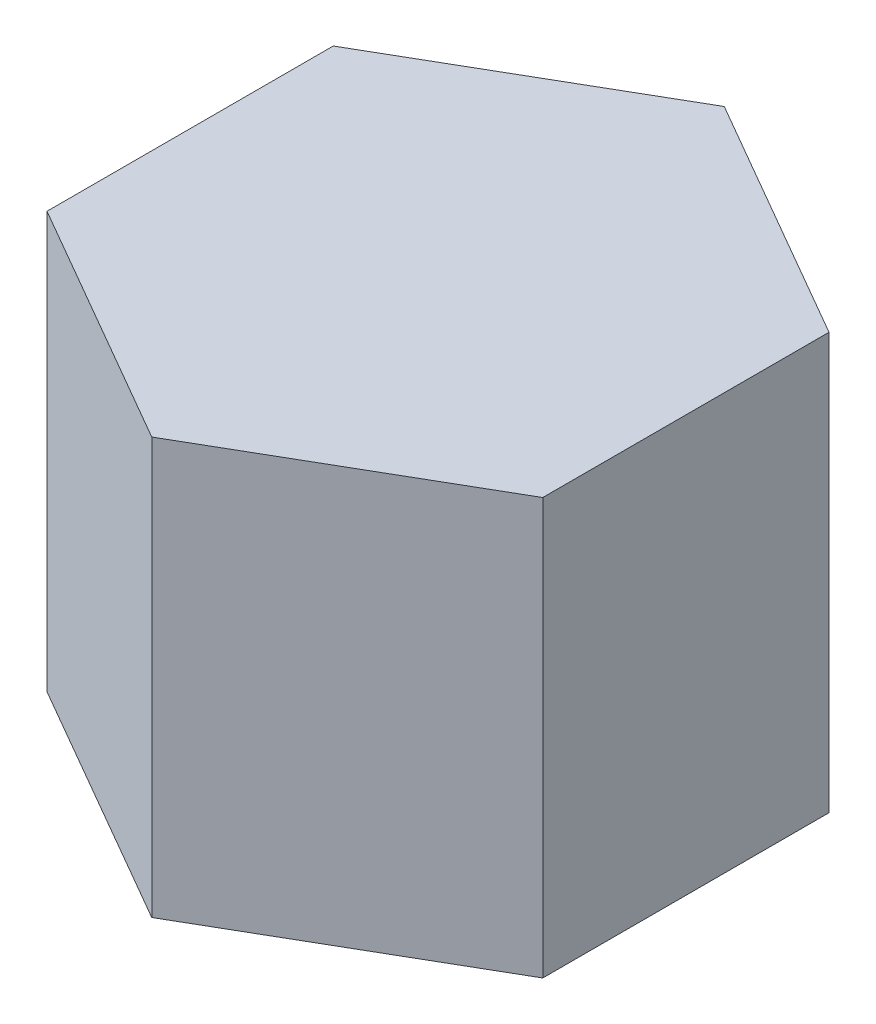
ISO-10303-21;
HEADER;
FILE_DESCRIPTION(('STEP AP214'),'2;1');
FILE_NAME('part.step','',(''),(''),'','','');
FILE_SCHEMA(('AUTOMOTIVE_DESIGN { 1 0 10303 214 1 1 1 1 }'));
ENDSEC;
DATA;
#1=APPLICATION_CONTEXT('core data for automotive mechanical design processes');
#2=APPLICATION_PROTOCOL_DEFINITION('international standard','automotive_design',2000,#1);
#3=PRODUCT_CONTEXT('',#1,'mechanical');
#4=PRODUCT('Part','Part','',(#3));
#5=PRODUCT_RELATED_PRODUCT_CATEGORY('part','',(#4));
#6=PRODUCT_DEFINITION_FORMATION('','',#4);
#7=PRODUCT_DEFINITION_CONTEXT('part definition',#1,'design');
#8=PRODUCT_DEFINITION('design','',#6,#7);
#9=PRODUCT_DEFINITION_SHAPE('','',#8);
#10=(LENGTH_UNIT() NAMED_UNIT(*) SI_UNIT(.MILLI.,.METRE.));
#11=(NAMED_UNIT(*) PLANE_ANGLE_UNIT() SI_UNIT($,.RADIAN.));
#12=(NAMED_UNIT(*) SI_UNIT($,.STERADIAN.) SOLID_ANGLE_UNIT());
#13=UNCERTAINTY_MEASURE_WITH_UNIT(LENGTH_MEASURE(1.E-05),#10,'distance_accuracy_value','');
#14=(GEOMETRIC_REPRESENTATION_CONTEXT(3) GLOBAL_UNCERTAINTY_ASSIGNED_CONTEXT((#13)) GLOBAL_UNIT_ASSIGNED_CONTEXT((#10,
#11,#12)) REPRESENTATION_CONTEXT('',''));
#15=CARTESIAN_POINT('',(0.,0.,0.));
#16=DIRECTION('',(0.,0.,1.));
#17=DIRECTION('',(1.,0.,0.));
#18=AXIS2_PLACEMENT_3D('',#15,#16,#17);
#19=CARTESIAN_POINT('',(202.839551417382,-147.556598747966,296.012098239417));
#20=DIRECTION('',(-0.500000000000096,0.,-0.866025403784383));
#21=DIRECTION('',(-0.866025403784383,0.,0.500000000000096));
#22=AXIS2_PLACEMENT_3D('',#19,#20,#21);
#23=PLANE('',#22);
#24=CARTESIAN_POINT('',(203.142660308706,-147.047793579175,295.837098239417));
#25=DIRECTION('',(-0.866025403784383,0.,0.500000000000096));
#26=VECTOR('',#25,1.);
#27=LINE('',#24,#26);
#28=CARTESIAN_POINT('',(203.142660308706,-147.047793579175,295.837098239417));
#29=VERTEX_POINT('',#28);
#30=CARTESIAN_POINT('',(202.839551417382,-147.047793579175,296.012098239417));
#31=VERTEX_POINT('',#30);
#32=EDGE_CURVE('E170',#29,#31,#27,.T.);
#33=ORIENTED_EDGE('',*,*,#32,.T.);
#34=CARTESIAN_POINT('',(202.839551417382,-147.556598747966,296.012098239417));
#35=DIRECTION('',(0.,1.,0.));
#36=VECTOR('',#35,1.);
#37=LINE('',#34,#36);
#38=CARTESIAN_POINT('',(202.839551417382,-147.556598747966,296.012098239417));
#39=VERTEX_POINT('',#38);
#40=EDGE_CURVE('E35',#39,#31,#37,.T.);
#41=ORIENTED_EDGE('',*,*,#40,.F.);
#42=CARTESIAN_POINT('',(203.142660308706,-147.556598747966,295.837098239417));
#43=DIRECTION('',(-0.866025403784383,0.,0.500000000000096));
#44=VECTOR('',#43,1.);
#45=LINE('',#42,#44);
#46=CARTESIAN_POINT('',(203.142660308706,-147.556598747966,295.837098239417));
#47=VERTEX_POINT('',#46);
#48=EDGE_CURVE('E159',#47,#39,#45,.T.);
#49=ORIENTED_EDGE('',*,*,#48,.F.);
#50=CARTESIAN_POINT('',(203.142660308706,-147.556598747966,295.837098239417));
#51=DIRECTION('',(0.,1.,0.));
#52=VECTOR('',#51,1.);
#53=LINE('',#50,#52);
#54=EDGE_CURVE('E10',#47,#29,#53,.T.);
#55=ORIENTED_EDGE('',*,*,#54,.T.);
#56=EDGE_LOOP('',(#33,#41,#49,#55));
#57=FACE_BOUND('',#56,.T.);
#58=ADVANCED_FACE('F16',(#57),#23,.F.);
#59=CARTESIAN_POINT('',(203.142660308706,-147.556598747966,291.594471220494));
#60=DIRECTION('',(-1.,0.,0.));
#61=DIRECTION('',(0.,-1.,0.));
#62=AXIS2_PLACEMENT_3D('',#59,#60,#61);
#63=PLANE('',#62);
#64=CARTESIAN_POINT('',(203.142660308706,-147.047793579175,295.487098239417));
#65=DIRECTION('',(0.,0.,1.));
#66=VECTOR('',#65,1.);
#67=LINE('',#64,#66);
#68=CARTESIAN_POINT('',(203.142660308706,-147.047793579175,295.487098239417));
#69=VERTEX_POINT('',#68);
#70=EDGE_CURVE('E167',#69,#29,#67,.T.);
#71=ORIENTED_EDGE('',*,*,#70,.T.);
#72=ORIENTED_EDGE('',*,*,#54,.F.);
#73=CARTESIAN_POINT('',(203.142660308706,-147.556598747966,295.487098239417));
#74=DIRECTION('',(0.,0.,1.));
#75=VECTOR('',#74,1.);
#76=LINE('',#73,#75);
#77=CARTESIAN_POINT('',(203.142660308706,-147.556598747966,295.487098239417));
#78=VERTEX_POINT('',#77);
#79=EDGE_CURVE('E156',#78,#47,#76,.T.);
#80=ORIENTED_EDGE('',*,*,#79,.F.);
#81=CARTESIAN_POINT('',(203.142660308706,-147.556598747966,295.487098239417));
#82=DIRECTION('',(0.,1.,0.));
#83=VECTOR('',#82,1.);
#84=LINE('',#81,#83);
#85=EDGE_CURVE('E27',#78,#69,#84,.T.);
#86=ORIENTED_EDGE('',*,*,#85,.T.);
#87=EDGE_LOOP('',(#71,#72,#80,#86));
#88=FACE_BOUND('',#87,.T.);
#89=ADVANCED_FACE('F189',(#88),#63,.F.);
#90=CARTESIAN_POINT('',(203.142660308706,-147.556598747966,295.487098239417));
#91=DIRECTION('',(-0.499999999999978,0.,0.866025403784452));
#92=DIRECTION('',(0.866025403784452,0.,0.499999999999978));
#93=AXIS2_PLACEMENT_3D('',#90,#91,#92);
#94=PLANE('',#93);
#95=CARTESIAN_POINT('',(202.839551417382,-147.047793579175,295.312098239417));
#96=DIRECTION('',(0.866025403784452,0.,0.499999999999978));
#97=VECTOR('',#96,1.);
#98=LINE('',#95,#97);
#99=CARTESIAN_POINT('',(202.839551417382,-147.047793579175,295.312098239417));
#100=VERTEX_POINT('',#99);
#101=EDGE_CURVE('E163',#100,#69,#98,.T.);
#102=ORIENTED_EDGE('',*,*,#101,.T.);
#103=ORIENTED_EDGE('',*,*,#85,.F.);
#104=CARTESIAN_POINT('',(202.839551417382,-147.556598747966,295.312098239417));
#105=DIRECTION('',(0.866025403784452,0.,0.499999999999978));
#106=VECTOR('',#105,1.);
#107=LINE('',#104,#106);
#108=CARTESIAN_POINT('',(202.839551417382,-147.556598747966,295.312098239417));
#109=VERTEX_POINT('',#108);
#110=EDGE_CURVE('E106',#109,#78,#107,.T.);
#111=ORIENTED_EDGE('',*,*,#110,.F.);
#112=CARTESIAN_POINT('',(202.839551417382,-147.556598747966,295.312098239417));
#113=DIRECTION('',(0.,1.,0.));
#114=VECTOR('',#113,1.);
#115=LINE('',#112,#114);
#116=EDGE_CURVE('E94',#109,#100,#115,.T.);
#117=ORIENTED_EDGE('',*,*,#116,.T.);
#118=EDGE_LOOP('',(#102,#103,#111,#117));
#119=FACE_BOUND('',#118,.T.);
#120=ADVANCED_FACE('F198',(#119),#94,.F.);
#121=CARTESIAN_POINT('',(202.839551417382,-147.556598747966,295.312098239417));
#122=DIRECTION('',(0.499999999999978,0.,0.866025403784452));
#123=DIRECTION('',(0.866025403784452,0.,-0.499999999999978));
#124=AXIS2_PLACEMENT_3D('',#121,#122,#123);
#125=PLANE('',#124);
#126=CARTESIAN_POINT('',(202.536442526057,-147.047793579175,295.487098239417));
#127=DIRECTION('',(0.866025403784452,0.,-0.499999999999978));
#128=VECTOR('',#127,1.);
#129=LINE('',#126,#128);
#130=CARTESIAN_POINT('',(202.536442526057,-147.047793579175,295.487098239417));
#131=VERTEX_POINT('',#130);
#132=EDGE_CURVE('E162',#131,#100,#129,.T.);
#133=ORIENTED_EDGE('',*,*,#132,.T.);
#134=ORIENTED_EDGE('',*,*,#116,.F.);
#135=CARTESIAN_POINT('',(202.536442526057,-147.556598747966,295.487098239417));
#136=DIRECTION('',(0.866025403784452,0.,-0.499999999999978));
#137=VECTOR('',#136,1.);
#138=LINE('',#135,#137);
#139=CARTESIAN_POINT('',(202.536442526057,-147.556598747966,295.487098239417));
#140=VERTEX_POINT('',#139);
#141=EDGE_CURVE('E98',#140,#109,#138,.T.);
#142=ORIENTED_EDGE('',*,*,#141,.F.);
#143=CARTESIAN_POINT('',(202.536442526057,-147.556598747966,295.487098239417));
#144=DIRECTION('',(0.,1.,0.));
#145=VECTOR('',#144,1.);
#146=LINE('',#143,#145);
#147=EDGE_CURVE('E79',#140,#131,#146,.T.);
#148=ORIENTED_EDGE('',*,*,#147,.T.);
#149=EDGE_LOOP('',(#133,#134,#142,#148));
#150=FACE_BOUND('',#149,.T.);
#151=ADVANCED_FACE('F100',(#150),#125,.F.);
#152=CARTESIAN_POINT('',(202.536442526057,-147.556598747966,291.594471220494));
#153=DIRECTION('',(1.,0.,0.));
#154=DIRECTION('',(0.,1.,0.));
#155=AXIS2_PLACEMENT_3D('',#152,#153,#154);
#156=PLANE('',#155);
#157=CARTESIAN_POINT('',(202.536442526057,-147.047793579175,295.837098239417));
#158=DIRECTION('',(0.,0.,-1.));
#159=VECTOR('',#158,1.);
#160=LINE('',#157,#159);
#161=CARTESIAN_POINT('',(202.536442526057,-147.047793579175,295.837098239417));
#162=VERTEX_POINT('',#161);
#163=EDGE_CURVE('E88',#162,#131,#160,.T.);
#164=ORIENTED_EDGE('',*,*,#163,.T.);
#165=ORIENTED_EDGE('',*,*,#147,.F.);
#166=CARTESIAN_POINT('',(202.536442526057,-147.556598747966,295.837098239417));
#167=DIRECTION('',(0.,0.,-1.));
#168=VECTOR('',#167,1.);
#169=LINE('',#166,#168);
#170=CARTESIAN_POINT('',(202.536442526057,-147.556598747966,295.837098239417));
#171=VERTEX_POINT('',#170);
#172=EDGE_CURVE('E84',#171,#140,#169,.T.);
#173=ORIENTED_EDGE('',*,*,#172,.F.);
#174=CARTESIAN_POINT('',(202.536442526057,-147.556598747966,295.837098239417));
#175=DIRECTION('',(0.,1.,0.));
#176=VECTOR('',#175,1.);
#177=LINE('',#174,#176);
#178=EDGE_CURVE('E58',#171,#162,#177,.T.);
#179=ORIENTED_EDGE('',*,*,#178,.T.);
#180=EDGE_LOOP('',(#164,#165,#173,#179));
#181=FACE_BOUND('',#180,.T.);
#182=ADVANCED_FACE('F82',(#181),#156,.F.);
#183=CARTESIAN_POINT('',(202.536442526057,-147.556598747966,295.837098239417));
#184=DIRECTION('',(0.499999999999978,0.,-0.866025403784452));
#185=DIRECTION('',(-0.866025403784452,0.,-0.499999999999978));
#186=AXIS2_PLACEMENT_3D('',#183,#184,#185);
#187=PLANE('',#186);
#188=CARTESIAN_POINT('',(202.839551417382,-147.047793579175,296.012098239417));
#189=DIRECTION('',(-0.866025403784452,0.,-0.499999999999978));
#190=VECTOR('',#189,1.);
#191=LINE('',#188,#190);
#192=EDGE_CURVE('E160',#31,#162,#191,.T.);
#193=ORIENTED_EDGE('',*,*,#192,.T.);
#194=ORIENTED_EDGE('',*,*,#178,.F.);
#195=CARTESIAN_POINT('',(202.839551417382,-147.556598747966,296.012098239417));
#196=DIRECTION('',(-0.866025403784452,0.,-0.499999999999978));
#197=VECTOR('',#196,1.);
#198=LINE('',#195,#197);
#199=EDGE_CURVE('E112',#39,#171,#198,.T.);
#200=ORIENTED_EDGE('',*,*,#199,.F.);
#201=ORIENTED_EDGE('',*,*,#40,.T.);
#202=EDGE_LOOP('',(#193,#194,#200,#201));
#203=FACE_BOUND('',#202,.T.);
#204=ADVANCED_FACE('F131',(#203),#187,.F.);
#205=CARTESIAN_POINT('',(206.491105863044,-147.556598747966,291.594471220494));
#206=DIRECTION('',(0.,1.,0.));
#207=DIRECTION('',(-1.,0.,0.));
#208=AXIS2_PLACEMENT_3D('',#205,#206,#207);
#209=PLANE('',#208);
#210=ORIENTED_EDGE('',*,*,#48,.T.);
#211=ORIENTED_EDGE('',*,*,#199,.T.);
#212=ORIENTED_EDGE('',*,*,#172,.T.);
#213=ORIENTED_EDGE('',*,*,#141,.T.);
#214=ORIENTED_EDGE('',*,*,#110,.T.);
#215=ORIENTED_EDGE('',*,*,#79,.T.);
#216=EDGE_LOOP('',(#210,#211,#212,#213,#214,#215));
#217=FACE_BOUND('',#216,.T.);
#218=ADVANCED_FACE('F111',(#217),#209,.F.);
#219=CARTESIAN_POINT('',(206.491105863044,-147.047793579175,291.594471220494));
#220=DIRECTION('',(0.,1.,0.));
#221=DIRECTION('',(-1.,0.,0.));
#222=AXIS2_PLACEMENT_3D('',#219,#220,#221);
#223=PLANE('',#222);
#224=ORIENTED_EDGE('',*,*,#32,.F.);
#225=ORIENTED_EDGE('',*,*,#70,.F.);
#226=ORIENTED_EDGE('',*,*,#101,.F.);
#227=ORIENTED_EDGE('',*,*,#132,.F.);
#228=ORIENTED_EDGE('',*,*,#163,.F.);
#229=ORIENTED_EDGE('',*,*,#192,.F.);
#230=EDGE_LOOP('',(#224,#225,#226,#227,#228,#229));
#231=FACE_BOUND('',#230,.T.);
#232=ADVANCED_FACE('F130',(#231),#223,.T.);
#233=CLOSED_SHELL('',(#58,#89,#120,#151,#182,#204,#218,#232));
#234=MANIFOLD_SOLID_BREP('B1',#233);
#235=ADVANCED_BREP_SHAPE_REPRESENTATION('',(#18,#234),#14);
#236=SHAPE_DEFINITION_REPRESENTATION(#9,#235);
ENDSEC;
END-ISO-10303-21;
